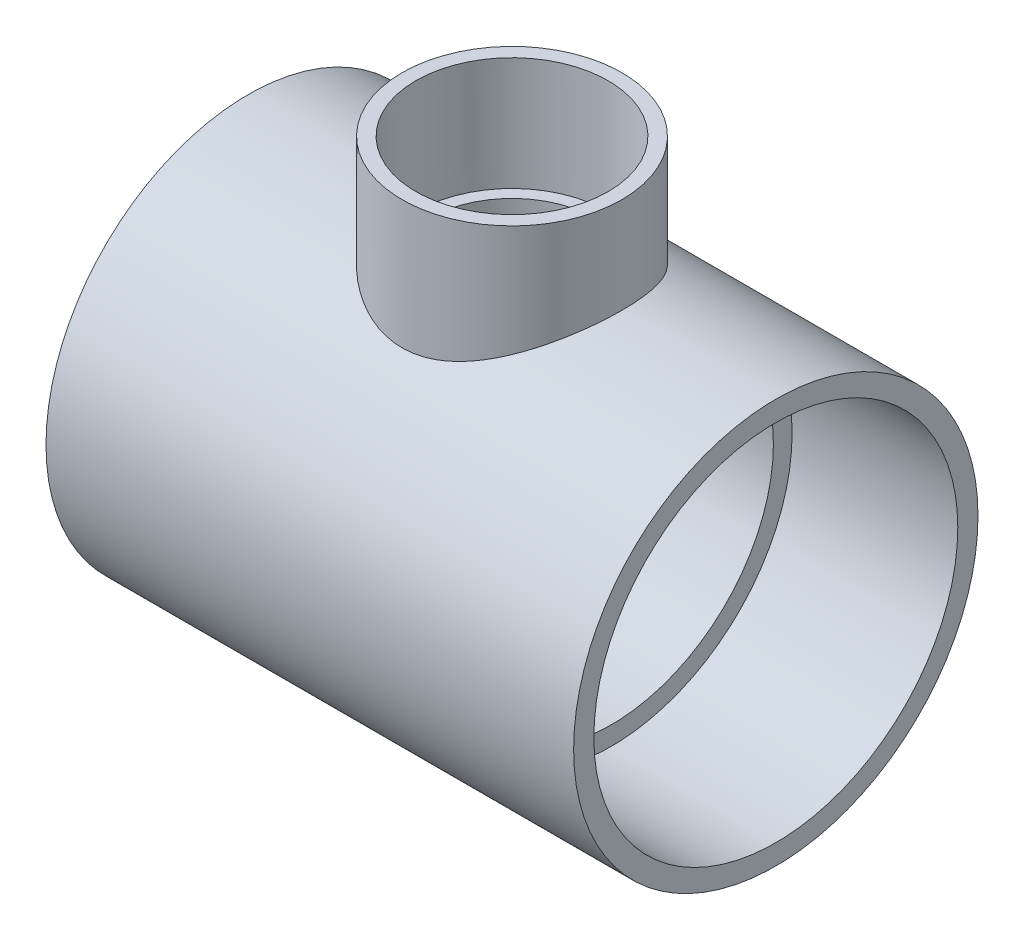
ISO-10303-21;
HEADER;
FILE_DESCRIPTION(('STEP AP214'),'2;1');
FILE_NAME('part.step','',(''),(''),'','','');
FILE_SCHEMA(('AUTOMOTIVE_DESIGN { 1 0 10303 214 1 1 1 1 }'));
ENDSEC;
DATA;
#1=APPLICATION_CONTEXT('core data for automotive mechanical design processes');
#2=APPLICATION_PROTOCOL_DEFINITION('international standard','automotive_design',2000,#1);
#3=PRODUCT_CONTEXT('',#1,'mechanical');
#4=PRODUCT('Part','Part','',(#3));
#5=PRODUCT_RELATED_PRODUCT_CATEGORY('part','',(#4));
#6=PRODUCT_DEFINITION_FORMATION('','',#4);
#7=PRODUCT_DEFINITION_CONTEXT('part definition',#1,'design');
#8=PRODUCT_DEFINITION('design','',#6,#7);
#9=PRODUCT_DEFINITION_SHAPE('','',#8);
#10=(LENGTH_UNIT() NAMED_UNIT(*) SI_UNIT(.MILLI.,.METRE.));
#11=(NAMED_UNIT(*) PLANE_ANGLE_UNIT() SI_UNIT($,.RADIAN.));
#12=(NAMED_UNIT(*) SI_UNIT($,.STERADIAN.) SOLID_ANGLE_UNIT());
#13=UNCERTAINTY_MEASURE_WITH_UNIT(LENGTH_MEASURE(1.E-05),#10,'distance_accuracy_value','');
#14=(GEOMETRIC_REPRESENTATION_CONTEXT(3) GLOBAL_UNCERTAINTY_ASSIGNED_CONTEXT((#13)) GLOBAL_UNIT_ASSIGNED_CONTEXT((#10,
#11,#12)) REPRESENTATION_CONTEXT('',''));
#15=CARTESIAN_POINT('',(0.,0.,0.));
#16=DIRECTION('',(0.,0.,1.));
#17=DIRECTION('',(1.,0.,0.));
#18=AXIS2_PLACEMENT_3D('',#15,#16,#17);
#19=CARTESIAN_POINT('',(-31.2928,0.,0.));
#20=DIRECTION('',(1.,0.,0.));
#21=DIRECTION('',(0.,0.,-1.));
#22=AXIS2_PLACEMENT_3D('',#19,#20,#21);
#23=PLANE('',#22);
#24=CARTESIAN_POINT('',(-31.2928,0.,0.));
#25=DIRECTION('',(-1.,0.,0.));
#26=DIRECTION('',(0.,0.,1.));
#27=AXIS2_PLACEMENT_3D('',#24,#25,#26);
#28=CIRCLE('',#27,57.0357);
#29=CARTESIAN_POINT('',(-31.2928,0.,57.0357));
#30=VERTEX_POINT('',#29);
#31=EDGE_CURVE('E97',#30,#30,#28,.T.);
#32=ORIENTED_EDGE('',*,*,#31,.T.);
#33=EDGE_LOOP('',(#32));
#34=FACE_BOUND('',#33,.T.);
#35=CARTESIAN_POINT('',(-31.2928,0.,0.));
#36=DIRECTION('',(1.,0.,0.));
#37=DIRECTION('',(0.,0.,-1.));
#38=AXIS2_PLACEMENT_3D('',#35,#36,#37);
#39=CIRCLE('',#38,51.1302);
#40=CARTESIAN_POINT('',(-31.2928,0.,-51.1302));
#41=VERTEX_POINT('',#40);
#42=EDGE_CURVE('E100',#41,#41,#39,.T.);
#43=ORIENTED_EDGE('',*,*,#42,.T.);
#44=EDGE_LOOP('',(#43));
#45=FACE_BOUND('',#44,.T.);
#46=ADVANCED_FACE('F30',(#34,#45),#23,.F.);
#47=CARTESIAN_POINT('',(31.2928,0.,0.));
#48=DIRECTION('',(1.,0.,0.));
#49=DIRECTION('',(0.,0.,-1.));
#50=AXIS2_PLACEMENT_3D('',#47,#48,#49);
#51=PLANE('',#50);
#52=CARTESIAN_POINT('',(31.2928,0.,0.));
#53=DIRECTION('',(1.,0.,0.));
#54=DIRECTION('',(0.,0.,-1.));
#55=AXIS2_PLACEMENT_3D('',#52,#53,#54);
#56=CIRCLE('',#55,51.1302);
#57=CARTESIAN_POINT('',(31.2928,0.,-51.1302));
#58=VERTEX_POINT('',#57);
#59=EDGE_CURVE('E103',#58,#58,#56,.T.);
#60=ORIENTED_EDGE('',*,*,#59,.F.);
#61=EDGE_LOOP('',(#60));
#62=FACE_BOUND('',#61,.T.);
#63=CARTESIAN_POINT('',(31.2928,0.,0.));
#64=DIRECTION('',(1.,0.,0.));
#65=DIRECTION('',(0.,0.,-1.));
#66=AXIS2_PLACEMENT_3D('',#63,#64,#65);
#67=CIRCLE('',#66,57.0357);
#68=CARTESIAN_POINT('',(31.2928,0.,-57.0357));
#69=VERTEX_POINT('',#68);
#70=EDGE_CURVE('E10',#69,#69,#67,.F.);
#71=ORIENTED_EDGE('',*,*,#70,.F.);
#72=EDGE_LOOP('',(#71));
#73=FACE_BOUND('',#72,.T.);
#74=ADVANCED_FACE('F72',(#62,#73),#51,.T.);
#75=CARTESIAN_POINT('',(31.2928,0.,0.));
#76=DIRECTION('',(-1.,0.,0.));
#77=DIRECTION('',(0.,0.,1.));
#78=AXIS2_PLACEMENT_3D('',#75,#76,#77);
#79=CYLINDRICAL_SURFACE('',#78,63.754);
#80=CARTESIAN_POINT('',(-83.185,0.,0.));
#81=DIRECTION('',(-1.,0.,0.));
#82=DIRECTION('',(0.,0.,1.));
#83=AXIS2_PLACEMENT_3D('',#80,#81,#82);
#84=CIRCLE('',#83,63.754);
#85=CARTESIAN_POINT('',(-83.185,0.,63.754));
#86=VERTEX_POINT('',#85);
#87=EDGE_CURVE('E114',#86,#86,#84,.T.);
#88=ORIENTED_EDGE('',*,*,#87,.F.);
#89=EDGE_LOOP('',(#88));
#90=FACE_BOUND('',#89,.T.);
#91=CARTESIAN_POINT('',(83.185,0.,0.));
#92=DIRECTION('',(-1.,0.,0.));
#93=DIRECTION('',(0.,0.,1.));
#94=AXIS2_PLACEMENT_3D('',#91,#92,#93);
#95=CIRCLE('',#94,63.754);
#96=CARTESIAN_POINT('',(83.185,0.,63.754));
#97=VERTEX_POINT('',#96);
#98=EDGE_CURVE('E102',#97,#97,#95,.T.);
#99=ORIENTED_EDGE('',*,*,#98,.T.);
#100=EDGE_LOOP('',(#99));
#101=FACE_BOUND('',#100,.T.);
#102=CARTESIAN_POINT('',(31.2928,61.9817199409632,-14.9277898283704));
#103=CARTESIAN_POINT('',(30.8590157260192,61.7627119969885,-15.8371083722885));
#104=CARTESIAN_POINT('',(30.3869858184902,61.5277706665448,-16.7245584747261));
#105=CARTESIAN_POINT('',(29.3712803613428,61.0325307236944,-18.450185129861));
#106=CARTESIAN_POINT('',(28.8275798090315,60.77222327048,-19.2883443389182));
#107=CARTESIAN_POINT('',(27.6722196390954,60.2327536392147,-20.9122231813222));
#108=CARTESIAN_POINT('',(27.0604465862179,59.9535603028201,-21.6978516831449));
#109=CARTESIAN_POINT('',(25.7740308973493,59.3840243508343,-23.2112894022233));
#110=CARTESIAN_POINT('',(25.0993932703106,59.0936826246117,-23.9391032175184));
#111=CARTESIAN_POINT('',(23.6928543122952,58.5101460612098,-25.331877550225));
#112=CARTESIAN_POINT('',(22.9610995248884,58.2169601124104,-25.9969898391331));
#113=CARTESIAN_POINT('',(21.442442915724,57.634892187325,-27.2631113880132));
#114=CARTESIAN_POINT('',(20.655539977556,57.3460102983133,-27.8641193496459));
#115=CARTESIAN_POINT('',(19.030197166982,56.7808263032757,-28.9984802330891));
#116=CARTESIAN_POINT('',(18.1917620458315,56.5045230415798,-29.531839378255));
#117=CARTESIAN_POINT('',(16.4670411902507,55.9730735799562,-30.5271343246348));
#118=CARTESIAN_POINT('',(15.5807556884279,55.7179272771967,-30.989070473004));
#119=CARTESIAN_POINT('',(13.7546630167047,55.2349627080885,-31.8420229499765));
#120=CARTESIAN_POINT('',(12.8143684209483,55.0074816964567,-32.232189060062));
#121=CARTESIAN_POINT('',(10.8949439156419,54.5922837755252,-32.9305416416512));
#122=CARTESIAN_POINT('',(9.91581349196638,54.4045673928557,-33.2387270274421));
#123=CARTESIAN_POINT('',(8.42492269087113,54.1593303687712,-33.6357448659006));
#124=CARTESIAN_POINT('',(7.9245748237696,54.0836763788385,-33.7571527206711));
#125=CARTESIAN_POINT('',(6.91728389396405,53.9452913573147,-33.9778618127677));
#126=CARTESIAN_POINT('',(6.41034177538884,53.8825584969344,-34.077166178667));
#127=CARTESIAN_POINT('',(5.39109966152885,53.7708256578644,-34.2532000139368));
#128=CARTESIAN_POINT('',(4.87880021618588,53.7218242836858,-34.3299317773315));
#129=CARTESIAN_POINT('',(3.85017817729677,53.6381876565941,-34.4604592681911));
#130=CARTESIAN_POINT('',(3.33385576397771,53.6035517638416,-34.5142560171861));
#131=CARTESIAN_POINT('',(1.930240308997,53.5297940522695,-34.6286259688408));
#132=CARTESIAN_POINT('',(1.04021689631093,53.5049941199507,-34.6668184035609));
#133=CARTESIAN_POINT('',(-0.740049868829083,53.4999926819212,-34.6745319127994));
#134=CARTESIAN_POINT('',(-1.63029318871182,53.5197865304321,-34.6440601407522));
#135=CARTESIAN_POINT('',(-3.40382496706583,53.6031309317315,-34.5149639876215));
#136=CARTESIAN_POINT('',(-4.28711286346325,53.6666849848518,-34.4163341546454));
#137=CARTESIAN_POINT('',(-6.03963643704365,53.835030589259,-34.1523993387477));
#138=CARTESIAN_POINT('',(-6.90887200378728,53.9398224644761,-33.9870938320768));
#139=CARTESIAN_POINT('',(-8.56677185903075,54.178026010521,-33.6059620665459));
#140=CARTESIAN_POINT('',(-9.35681045647687,54.3089140699209,-33.3944937352499));
#141=CARTESIAN_POINT('',(-10.9151688799396,54.5989839275586,-32.918097963334));
#142=CARTESIAN_POINT('',(-11.683490122599,54.7581638753311,-32.6531740188901));
#143=CARTESIAN_POINT('',(-13.1950748388329,55.1004729926893,-32.0721685408978));
#144=CARTESIAN_POINT('',(-13.9383356877965,55.2836046610337,-31.756081668968));
#145=CARTESIAN_POINT('',(-15.3971995681991,55.6693165648451,-31.0749563253676));
#146=CARTESIAN_POINT('',(-16.1127901868438,55.8719053899754,-30.709896205218));
#147=CARTESIAN_POINT('',(-17.6003281307498,56.3178650873149,-29.8850576231795));
#148=CARTESIAN_POINT('',(-18.3682969272791,56.5631807390275,-29.419148535285));
#149=CARTESIAN_POINT('',(-19.8628047059328,57.066015474453,-28.4314852721516));
#150=CARTESIAN_POINT('',(-20.5893554947366,57.3235310417242,-27.9097471348749));
#151=CARTESIAN_POINT('',(-21.9990157673711,57.8448086469135,-26.8126760334663));
#152=CARTESIAN_POINT('',(-22.6821039352303,58.1085736641231,-26.2373171071353));
#153=CARTESIAN_POINT('',(-24.0018281648006,58.6363046660367,-25.0357113550186));
#154=CARTESIAN_POINT('',(-24.6384655101702,58.9002706449832,-24.4094659364819));
#155=CARTESIAN_POINT('',(-25.8595321598407,59.421430074098,-23.1117421225272));
#156=CARTESIAN_POINT('',(-26.4442057364654,59.6786507108816,-22.4405045915711));
#157=CARTESIAN_POINT('',(-27.5619883191471,60.1822941225901,-21.0525289612542));
#158=CARTESIAN_POINT('',(-28.0950969751883,60.4287168242138,-20.3357905530939));
#159=CARTESIAN_POINT('',(-29.1064385894238,60.9055024669891,-18.8598379433071));
#160=CARTESIAN_POINT('',(-29.5846889308458,61.1358704863371,-18.1006373109655));
#161=CARTESIAN_POINT('',(-30.4831436195164,61.5756677132134,-16.5428102182876));
#162=CARTESIAN_POINT('',(-30.9033503130987,61.7850977670352,-15.7441853533935));
#163=CARTESIAN_POINT('',(-31.6658044163128,62.1700393611269,-14.1458681924474));
#164=CARTESIAN_POINT('',(-32.0105945315392,62.3466097387602,-13.3476450106495));
#165=CARTESIAN_POINT('',(-32.6407306497871,62.6724725955139,-11.7226385199715));
#166=CARTESIAN_POINT('',(-32.9260785488638,62.8217659446833,-10.8958561230386));
#167=CARTESIAN_POINT('',(-33.4344352890527,63.0896906315885,-9.21869501277959));
#168=CARTESIAN_POINT('',(-33.6574607584534,63.2083301474558,-8.36832266019623));
#169=CARTESIAN_POINT('',(-34.0388191461918,63.4122187888412,-6.64922211492018));
#170=CARTESIAN_POINT('',(-34.1971521502629,63.4974679586099,-5.78049394655507));
#171=CARTESIAN_POINT('',(-34.447578241495,63.6326862548744,-4.02837749354464));
#172=CARTESIAN_POINT('',(-34.5394905111318,63.6825590693826,-3.14495583857812));
#173=CARTESIAN_POINT('',(-34.6552130047454,63.7453974183923,-1.37234084747499));
#174=CARTESIAN_POINT('',(-34.6790230846354,63.7583628748072,-0.48314749913094));
#175=CARTESIAN_POINT('',(-34.6582337989739,63.747057763481,1.29417885321972));
#176=CARTESIAN_POINT('',(-34.6136358626651,63.7227879736926,2.18231187899158));
#177=CARTESIAN_POINT('',(-34.4566062592964,63.6376275673482,3.9507637942681));
#178=CARTESIAN_POINT('',(-34.3441756737503,63.57673753466,4.83108280813116));
#179=CARTESIAN_POINT('',(-34.0576904204966,63.4224450007617,6.54865891398556));
#180=CARTESIAN_POINT('',(-33.8857877053165,63.3301795620299,7.38637926750427));
#181=CARTESIAN_POINT('',(-33.4817551741187,63.1149189337697,9.04307995630684));
#182=CARTESIAN_POINT('',(-33.2496269463314,62.9919245546092,9.86206078515834));
#183=CARTESIAN_POINT('',(-32.7274503371776,62.7178675339297,11.4765951530468));
#184=CARTESIAN_POINT('',(-32.4373943875603,62.5668012249955,12.2721456153083));
#185=CARTESIAN_POINT('',(-31.8020101791536,62.2397619000605,13.8355518113807));
#186=CARTESIAN_POINT('',(-31.4566794043849,62.063787750356,14.6034062825851));
#187=CARTESIAN_POINT('',(-30.6924421299424,61.6798588457154,16.1504864498908));
#188=CARTESIAN_POINT('',(-30.270474817673,61.4706567832863,16.927889933097));
#189=CARTESIAN_POINT('',(-29.3711842018429,61.0328312919572,18.44421027889));
#190=CARTESIAN_POINT('',(-28.8938593456369,60.8042073183677,19.1831260611472));
#191=CARTESIAN_POINT('',(-27.8867704846506,60.3321498334306,20.6198014726789));
#192=CARTESIAN_POINT('',(-27.3569831276333,60.0887097458477,21.3175425516329));
#193=CARTESIAN_POINT('',(-26.2480690740639,59.5920268893773,22.6689479023861));
#194=CARTESIAN_POINT('',(-25.6689395112762,59.3387835514964,23.3226096097056));
#195=CARTESIAN_POINT('',(-24.3943292575001,58.7980183657223,24.6564721411008));
#196=CARTESIAN_POINT('',(-23.6931396560497,58.5099210883499,25.3309904609271));
#197=CARTESIAN_POINT('',(-22.2360955457662,57.9352237062824,26.6191617790265));
#198=CARTESIAN_POINT('',(-21.4802368485735,57.6486237181066,27.232810105312));
#199=CARTESIAN_POINT('',(-20.3079598339419,57.2256462016266,28.1052066017641));
#200=CARTESIAN_POINT('',(-19.910580212244,57.0857400539315,28.3881206032739));
#201=CARTESIAN_POINT('',(-19.1034526091876,56.8092635985235,28.937425246869));
#202=CARTESIAN_POINT('',(-18.6937057818872,56.6726929816909,29.2038174236611));
#203=CARTESIAN_POINT('',(-17.8623207372737,56.4039189894311,29.7196065190802));
#204=CARTESIAN_POINT('',(-17.4406839157479,56.2717151053091,29.9690054209319));
#205=CARTESIAN_POINT('',(-16.5858296887173,56.0126592663368,30.4504395946741));
#206=CARTESIAN_POINT('',(-16.1526081659364,55.8858092567201,30.6824685788087));
#207=CARTESIAN_POINT('',(-14.8071214493913,55.5066528972256,31.3665723160076));
#208=CARTESIAN_POINT('',(-13.8767390249412,55.2648382028659,31.7893942476696));
#209=CARTESIAN_POINT('',(-11.9745614247553,54.818161551834,32.5536180322939));
#210=CARTESIAN_POINT('',(-11.0027732967994,54.6132933372169,32.8950336769053));
#211=CARTESIAN_POINT('',(-9.52024599770114,54.3405306656693,33.3423073707075));
#212=CARTESIAN_POINT('',(-9.02222051620707,54.2554051098887,33.4805299189212));
#213=CARTESIAN_POINT('',(-8.01872217418492,54.0975866701437,33.7349388088565));
#214=CARTESIAN_POINT('',(-7.51325130023228,54.0248905327733,33.8511309179259));
#215=CARTESIAN_POINT('',(-6.4959617836311,53.8928334574071,34.0609807616227));
#216=CARTESIAN_POINT('',(-5.984143640097,53.8334714778148,34.1546402564237));
#217=CARTESIAN_POINT('',(-4.95542399030367,53.728841810527,34.3189957217159));
#218=CARTESIAN_POINT('',(-4.43852235182022,53.6835744904461,34.3896910932626));
#219=CARTESIAN_POINT('',(-3.023001970109,53.5801689106746,34.5507370130441));
#220=CARTESIAN_POINT('',(-2.12050998660511,53.5366611731156,34.6179140238652));
#221=CARTESIAN_POINT('',(-0.312180674103934,53.4955539964042,34.6814004034605));
#222=CARTESIAN_POINT('',(0.593656321705804,53.4979501019812,34.6777166497389));
#223=CARTESIAN_POINT('',(2.40095664431662,53.5485108708599,34.5995902926598));
#224=CARTESIAN_POINT('',(3.30242014876652,53.5966736592317,34.5251505879708));
#225=CARTESIAN_POINT('',(5.09338427765766,53.7367630337967,34.3066983777072));
#226=CARTESIAN_POINT('',(5.98288501545281,53.8286892050065,34.1626865318458));
#227=CARTESIAN_POINT('',(7.66554480441538,54.0427663920452,33.8228966861659));
#228=CARTESIAN_POINT('',(8.46029249473335,54.1615448703197,33.6327907896006));
#229=CARTESIAN_POINT('',(10.0296854897123,54.4287695498728,33.1985916451331));
#230=CARTESIAN_POINT('',(10.8043323884655,54.5772133903669,32.954502693065));
#231=CARTESIAN_POINT('',(12.3298927033022,54.8995853872136,32.4146076986792));
#232=CARTESIAN_POINT('',(13.0808055225499,55.073514183812,32.1188003570302));
#233=CARTESIAN_POINT('',(14.5561708679692,55.4424555391385,31.4776657412687));
#234=CARTESIAN_POINT('',(15.2806115209787,55.6374774068384,31.1323165808207));
#235=CARTESIAN_POINT('',(16.7790152604586,56.0665559202165,30.3534636635644));
#236=CARTESIAN_POINT('',(17.5495534580945,56.3025427129571,29.9144302022044));
#237=CARTESIAN_POINT('',(19.0513452523632,56.7885837579292,28.9811314097596));
#238=CARTESIAN_POINT('',(19.7826099385979,57.0386339978242,28.4868817926866));
#239=CARTESIAN_POINT('',(21.2041294232385,57.5470976758175,27.4452213408323));
#240=CARTESIAN_POINT('',(21.8943506366456,57.8055177027721,26.8977679097205));
#241=CARTESIAN_POINT('',(23.230672729586,58.32477478719,25.7524479512599));
#242=CARTESIAN_POINT('',(23.8767709547787,58.585611988995,25.154578395816));
#243=CARTESIAN_POINT('',(25.2065373432324,59.1392467596604,23.8266011172745));
#244=CARTESIAN_POINT('',(25.8834741637554,59.4315973075085,23.0895434348852));
#245=CARTESIAN_POINT('',(27.1731877125408,60.0045214734233,21.5568852526774));
#246=CARTESIAN_POINT('',(27.7859585469953,60.2850940082341,20.761279386469));
#247=CARTESIAN_POINT('',(28.94290677774,60.8270080337658,19.115390521678));
#248=CARTESIAN_POINT('',(29.4870827497773,61.0883491251323,18.2651063883496));
#249=CARTESIAN_POINT('',(30.5020328127949,61.584675969964,16.5144706367309));
#250=CARTESIAN_POINT('',(30.9728114350892,61.8196633501703,15.6141221139129));
#251=CARTESIAN_POINT('',(31.8276462943572,62.2523904690329,13.7868280288271));
#252=CARTESIAN_POINT('',(32.2132113260632,62.450765835963,12.8607405101482));
#253=CARTESIAN_POINT('',(32.9044465417655,62.81010780857,10.9720855456869));
#254=CARTESIAN_POINT('',(33.2101163052584,62.9710742173561,10.0095179079334));
#255=CARTESIAN_POINT('',(33.7371626032025,63.2506166811276,8.05632863902142));
#256=CARTESIAN_POINT('',(33.9586048747134,63.3692257902926,7.06572953707439));
#257=CARTESIAN_POINT('',(34.3141339942874,63.5604554222354,5.06464932910696));
#258=CARTESIAN_POINT('',(34.4482333366299,63.6330825226312,4.05417108808283));
#259=CARTESIAN_POINT('',(34.6165089651071,63.7243499229653,2.14166585746811));
#260=CARTESIAN_POINT('',(34.6605188318735,63.7483007582361,1.24074205350694));
#261=CARTESIAN_POINT('',(34.6781591659134,63.7578926854044,-0.561995017245191));
#262=CARTESIAN_POINT('',(34.6517931123217,63.7435356711056,-1.46380823786335));
#263=CARTESIAN_POINT('',(34.5290792272637,63.6769108739921,-3.26058236225636));
#264=CARTESIAN_POINT('',(34.4327795760145,63.6246691915647,-4.15554755518202));
#265=CARTESIAN_POINT('',(34.1714969872717,63.4836462830197,-5.93237598240269));
#266=CARTESIAN_POINT('',(34.0065244288954,63.3948705786208,-6.81424117576024));
#267=CARTESIAN_POINT('',(33.6652548506906,63.212571847357,-8.31536887038683));
#268=CARTESIAN_POINT('',(33.5049222314398,63.1272644143739,-8.93933377242985));
#269=CARTESIAN_POINT('',(33.15052555494,62.9398836440735,-10.17516973609));
#270=CARTESIAN_POINT('',(32.9564566010695,62.8378078730536,-10.7870390277258));
#271=CARTESIAN_POINT('',(32.5357233521242,62.6181713999637,-11.9964490509977));
#272=CARTESIAN_POINT('',(32.309066614647,62.5006142887794,-12.5939930674952));
#273=CARTESIAN_POINT('',(31.824270777442,62.2513879599248,-13.773183478172));
#274=CARTESIAN_POINT('',(31.5661276545604,62.1197169391194,-14.3548278291339));
#275=CARTESIAN_POINT('',(31.2928,61.9817199409632,-14.9277898283704));
#276=B_SPLINE_CURVE_WITH_KNOTS('',3,(#102,#103,#104,#105,#106,#107,#108,#109,#110,#111,#112,
#113,#114,#115,#116,#117,#118,#119,#120,#121,#122,#123,#124,#125,#126,#127,#128,#129,#130,#131,
#132,#133,#134,#135,#136,#137,#138,#139,#140,#141,#142,#143,#144,#145,#146,#147,#148,#149,#150,
#151,#152,#153,#154,#155,#156,#157,#158,#159,#160,#161,#162,#163,#164,#165,#166,#167,#168,#169,
#170,#171,#172,#173,#174,#175,#176,#177,#178,#179,#180,#181,#182,#183,#184,#185,#186,#187,#188,
#189,#190,#191,#192,#193,#194,#195,#196,#197,#198,#199,#200,#201,#202,#203,#204,#205,#206,#207,
#208,#209,#210,#211,#212,#213,#214,#215,#216,#217,#218,#219,#220,#221,#222,#223,#224,#225,#226,
#227,#228,#229,#230,#231,#232,#233,#234,#235,#236,#237,#238,#239,#240,#241,#242,#243,#244,#245,
#246,#247,#248,#249,#250,#251,#252,#253,#254,#255,#256,#257,#258,#259,#260,#261,#262,#263,#264,
#265,#266,#267,#268,#269,#270,#271,#272,#273,#274,#275),.UNSPECIFIED.,.T.,.F.,(4,2,2,2,2,2,2,2,
2,2,2,2,2,2,2,2,2,2,2,2,2,2,2,2,2,2,2,2,2,2,2,2,2,2,2,2,2,2,2,2,2,2,2,2,2,2,2,2,2,2,2,2,2,2,2,2,
2,2,2,2,2,2,2,2,2,2,2,2,2,2,2,2,2,2,2,2,2,2,2,2,2,2,2,2,2,2,4),(0.,3.09239640093276,
6.18587447030999,9.28458694108796,12.3830527220089,15.4738148680344,18.5646396010415,
21.6551797869596,24.7457049506696,27.8707668341538,30.9958701023796,32.5565008667842,
34.1169105956358,35.6771616872528,37.2373432777143,39.9068909562617,42.5761605343,
45.2456436491576,47.91514773369,50.3973707271953,52.8794314276021,55.3617512753727,
57.845172063434,60.6357942157101,63.4256168496818,66.2167973525847,69.0079006925725,
71.7851003739573,74.5623189052898,77.3386549601541,80.1148787526322,82.7738710951512,
85.4327786095991,88.0909760203406,90.7491699083038,93.414573227688,96.0799821863819,
98.7453354576761,101.410646234089,103.988159234363,106.565604268947,109.143386267002,
111.72128563298,114.445297182074,117.169385151591,119.894691171355,122.620155609286,
125.661018428407,128.702114464212,130.22416670395,131.746077348357,133.267810070689,
134.790091009476,137.935977078128,141.081329799348,142.652215158557,144.222688706217,
145.793039533782,147.36343131555,150.077352833309,152.791010948431,155.504557897549,
158.218079116149,160.692759305192,163.167242636303,165.641788143285,168.11743022847,
170.867780611264,173.617350253948,176.369139697636,179.121094537285,182.245128582271,
185.369449326434,188.493834931002,191.618027569701,194.681448219034,197.744884991388,
200.805925912073,203.86652885907,206.57001099005,209.273359472986,211.974847269415,
214.675926915309,216.624366166174,218.573088457506,220.521359537613,222.46987981817),.UNSPECIFIED.);
#277=CARTESIAN_POINT('',(31.2928,61.9817199409632,-14.9277898283704));
#278=VERTEX_POINT('',#277);
#279=EDGE_CURVE('E55',#278,#278,#276,.T.);
#280=ORIENTED_EDGE('',*,*,#279,.F.);
#281=EDGE_LOOP('',(#280));
#282=FACE_BOUND('',#281,.T.);
#283=ADVANCED_FACE('F67',(#90,#101,#282),#79,.T.);
#284=CARTESIAN_POINT('',(-31.2928,0.,0.));
#285=DIRECTION('',(-1.,0.,0.));
#286=DIRECTION('',(0.,0.,1.));
#287=AXIS2_PLACEMENT_3D('',#284,#285,#286);
#288=CONICAL_SURFACE('',#287,57.0357,0.00660783334011333);
#289=CARTESIAN_POINT('',(-83.185,0.,0.));
#290=DIRECTION('',(-1.,0.,0.));
#291=DIRECTION('',(0.,0.,1.));
#292=AXIS2_PLACEMENT_3D('',#289,#290,#291);
#293=CIRCLE('',#292,57.3786);
#294=CARTESIAN_POINT('',(-83.185,0.,57.3786));
#295=VERTEX_POINT('',#294);
#296=EDGE_CURVE('E62',#295,#295,#293,.T.);
#297=ORIENTED_EDGE('',*,*,#296,.T.);
#298=EDGE_LOOP('',(#297));
#299=FACE_BOUND('',#298,.T.);
#300=ORIENTED_EDGE('',*,*,#31,.F.);
#301=EDGE_LOOP('',(#300));
#302=FACE_BOUND('',#301,.T.);
#303=ADVANCED_FACE('F71',(#299,#302),#288,.F.);
#304=CARTESIAN_POINT('',(83.185,0.,0.));
#305=DIRECTION('',(1.,0.,0.));
#306=DIRECTION('',(0.,0.,-1.));
#307=AXIS2_PLACEMENT_3D('',#304,#305,#306);
#308=CONICAL_SURFACE('',#307,57.3786,0.00660783334011306);
#309=CARTESIAN_POINT('',(83.185,0.,0.));
#310=DIRECTION('',(-1.,0.,0.));
#311=DIRECTION('',(0.,0.,1.));
#312=AXIS2_PLACEMENT_3D('',#309,#310,#311);
#313=CIRCLE('',#312,57.3786);
#314=CARTESIAN_POINT('',(83.185,0.,57.3786));
#315=VERTEX_POINT('',#314);
#316=EDGE_CURVE('E106',#315,#315,#313,.T.);
#317=ORIENTED_EDGE('',*,*,#316,.F.);
#318=EDGE_LOOP('',(#317));
#319=FACE_BOUND('',#318,.T.);
#320=ORIENTED_EDGE('',*,*,#70,.T.);
#321=EDGE_LOOP('',(#320));
#322=FACE_BOUND('',#321,.T.);
#323=ADVANCED_FACE('F84',(#319,#322),#308,.F.);
#324=CARTESIAN_POINT('',(0.,0.,0.));
#325=DIRECTION('',(0.,-1.,0.));
#326=DIRECTION('',(1.,0.,0.));
#327=AXIS2_PLACEMENT_3D('',#324,#325,#326);
#328=CYLINDRICAL_SURFACE('',#327,34.671);
#329=ORIENTED_EDGE('',*,*,#279,.T.);
#330=EDGE_LOOP('',(#329));
#331=FACE_BOUND('',#330,.T.);
#332=CARTESIAN_POINT('',(0.,93.98,0.));
#333=DIRECTION('',(0.,-1.,0.));
#334=DIRECTION('',(1.,0.,0.));
#335=AXIS2_PLACEMENT_3D('',#332,#333,#334);
#336=CIRCLE('',#335,34.671);
#337=CARTESIAN_POINT('',(34.671,93.98,0.));
#338=VERTEX_POINT('',#337);
#339=EDGE_CURVE('E43',#338,#338,#336,.T.);
#340=ORIENTED_EDGE('',*,*,#339,.T.);
#341=EDGE_LOOP('',(#340));
#342=FACE_BOUND('',#341,.T.);
#343=ADVANCED_FACE('F64',(#331,#342),#328,.T.);
#344=CARTESIAN_POINT('',(0.,93.98,0.));
#345=DIRECTION('',(0.,1.,0.));
#346=DIRECTION('',(-1.,0.,0.));
#347=AXIS2_PLACEMENT_3D('',#344,#345,#346);
#348=CONICAL_SURFACE('',#347,30.3149,0.00642848287391577);
#349=CARTESIAN_POINT('',(0.,93.98,0.));
#350=DIRECTION('',(0.,-1.,0.));
#351=DIRECTION('',(1.,0.,0.));
#352=AXIS2_PLACEMENT_3D('',#349,#350,#351);
#353=CIRCLE('',#352,30.3149);
#354=CARTESIAN_POINT('',(30.3149,93.98,0.));
#355=VERTEX_POINT('',#354);
#356=EDGE_CURVE('E52',#355,#355,#353,.T.);
#357=ORIENTED_EDGE('',*,*,#356,.F.);
#358=EDGE_LOOP('',(#357));
#359=FACE_BOUND('',#358,.T.);
#360=CARTESIAN_POINT('',(0.,58.42,0.));
#361=DIRECTION('',(0.,-1.,0.));
#362=DIRECTION('',(1.,0.,0.));
#363=AXIS2_PLACEMENT_3D('',#360,#361,#362);
#364=CIRCLE('',#363,30.0863);
#365=CARTESIAN_POINT('',(30.0863,58.42,0.));
#366=VERTEX_POINT('',#365);
#367=EDGE_CURVE('E47',#366,#366,#364,.T.);
#368=ORIENTED_EDGE('',*,*,#367,.T.);
#369=EDGE_LOOP('',(#368));
#370=FACE_BOUND('',#369,.T.);
#371=ADVANCED_FACE('F75',(#359,#370),#348,.F.);
#372=CARTESIAN_POINT('',(34.671,93.98,0.));
#373=DIRECTION('',(0.,1.,0.));
#374=DIRECTION('',(-1.,0.,0.));
#375=AXIS2_PLACEMENT_3D('',#372,#373,#374);
#376=PLANE('',#375);
#377=ORIENTED_EDGE('',*,*,#356,.T.);
#378=EDGE_LOOP('',(#377));
#379=FACE_BOUND('',#378,.T.);
#380=ORIENTED_EDGE('',*,*,#339,.F.);
#381=EDGE_LOOP('',(#380));
#382=FACE_BOUND('',#381,.T.);
#383=ADVANCED_FACE('F32',(#379,#382),#376,.T.);
#384=CARTESIAN_POINT('',(-83.185,-63.754,0.));
#385=DIRECTION('',(-1.,0.,0.));
#386=DIRECTION('',(0.,0.,1.));
#387=AXIS2_PLACEMENT_3D('',#384,#385,#386);
#388=PLANE('',#387);
#389=ORIENTED_EDGE('',*,*,#87,.T.);
#390=EDGE_LOOP('',(#389));
#391=FACE_BOUND('',#390,.T.);
#392=ORIENTED_EDGE('',*,*,#296,.F.);
#393=EDGE_LOOP('',(#392));
#394=FACE_BOUND('',#393,.T.);
#395=ADVANCED_FACE('F82',(#391,#394),#388,.T.);
#396=CARTESIAN_POINT('',(83.185,-63.754,0.));
#397=DIRECTION('',(1.,0.,0.));
#398=DIRECTION('',(0.,0.,-1.));
#399=AXIS2_PLACEMENT_3D('',#396,#397,#398);
#400=PLANE('',#399);
#401=ORIENTED_EDGE('',*,*,#316,.T.);
#402=EDGE_LOOP('',(#401));
#403=FACE_BOUND('',#402,.T.);
#404=ORIENTED_EDGE('',*,*,#98,.F.);
#405=EDGE_LOOP('',(#404));
#406=FACE_BOUND('',#405,.T.);
#407=ADVANCED_FACE('F122',(#403,#406),#400,.T.);
#408=CARTESIAN_POINT('',(0.,58.42,0.));
#409=DIRECTION('',(0.,-1.,0.));
#410=DIRECTION('',(1.,0.,0.));
#411=AXIS2_PLACEMENT_3D('',#408,#409,#410);
#412=PLANE('',#411);
#413=CARTESIAN_POINT('',(0.,58.42,0.));
#414=DIRECTION('',(0.,-1.,0.));
#415=DIRECTION('',(0.,0.,-1.));
#416=AXIS2_PLACEMENT_3D('',#413,#414,#415);
#417=CIRCLE('',#416,26.2509);
#418=CARTESIAN_POINT('',(0.,58.42,-26.2509));
#419=VERTEX_POINT('',#418);
#420=EDGE_CURVE('E154',#419,#419,#417,.T.);
#421=ORIENTED_EDGE('',*,*,#420,.T.);
#422=EDGE_LOOP('',(#421));
#423=FACE_BOUND('',#422,.T.);
#424=ORIENTED_EDGE('',*,*,#367,.F.);
#425=EDGE_LOOP('',(#424));
#426=FACE_BOUND('',#425,.T.);
#427=ADVANCED_FACE('F128',(#423,#426),#412,.F.);
#428=CARTESIAN_POINT('',(83.185,0.,0.));
#429=DIRECTION('',(1.,0.,0.));
#430=DIRECTION('',(0.,0.,-1.));
#431=AXIS2_PLACEMENT_3D('',#428,#429,#430);
#432=CYLINDRICAL_SURFACE('',#431,51.1302);
#433=CARTESIAN_POINT('',(0.,43.876959799307,-26.2509));
#434=CARTESIAN_POINT('',(0.681360378573567,43.8769615282513,-26.2508989027059));
#435=CARTESIAN_POINT('',(1.36274515454134,43.8928845956468,-26.2243378398937));
#436=CARTESIAN_POINT('',(2.72020613639835,43.9559679654755,-26.1184602524268));
#437=CARTESIAN_POINT('',(3.39627992839956,44.003141724596,-26.0391210011872));
#438=CARTESIAN_POINT('',(4.73872979111499,44.1270391806309,-25.8286013471756));
#439=CARTESIAN_POINT('',(5.40508706198772,44.2038138561949,-25.6973314993971));
#440=CARTESIAN_POINT('',(6.72212141352884,44.3841062591454,-25.3846596307875));
#441=CARTESIAN_POINT('',(7.37279982078404,44.4876217152498,-25.2032618675808));
#442=CARTESIAN_POINT('',(8.65091715025692,44.7172542704607,-24.7935331414108));
#443=CARTESIAN_POINT('',(9.27846569583563,44.8432417216127,-24.5654703478461));
#444=CARTESIAN_POINT('',(10.5108445560754,45.1143438683234,-24.0639672696687));
#445=CARTESIAN_POINT('',(11.1156744629179,45.2594589070276,-23.7905261709543));
#446=CARTESIAN_POINT('',(12.2998449303287,45.5647501640274,-23.2004565255452));
#447=CARTESIAN_POINT('',(12.8791867505425,45.7249256367918,-22.8838301162877));
#448=CARTESIAN_POINT('',(14.0101398409067,46.0562613759152,-22.2094412078197));
#449=CARTESIAN_POINT('',(14.5617486806249,46.2274226020494,-21.8516751122551));
#450=CARTESIAN_POINT('',(15.6819993598854,46.5919327799858,-21.0640327469858));
#451=CARTESIAN_POINT('',(16.2479292897617,46.7859147436644,-20.6305885180239));
#452=CARTESIAN_POINT('',(17.3420812706282,47.1770525060047,-19.7197546502493));
#453=CARTESIAN_POINT('',(17.8703015599427,47.3742084524183,-19.2423629607318));
#454=CARTESIAN_POINT('',(18.8868195610455,47.7669306933848,-18.2456758013194));
#455=CARTESIAN_POINT('',(19.3750974446156,47.9624961555266,-17.726359770446));
#456=CARTESIAN_POINT('',(20.3088762155935,48.3472550142516,-16.6483582324288));
#457=CARTESIAN_POINT('',(20.7543757373299,48.5364482072792,-16.0896714693866));
#458=CARTESIAN_POINT('',(21.6304087000466,48.9172310175402,-14.8937387191846));
#459=CARTESIAN_POINT('',(22.0575397094158,49.1080075601519,-14.2537330891056));
#460=CARTESIAN_POINT('',(22.85592185196,49.4717542286781,-12.9348669817345));
#461=CARTESIAN_POINT('',(23.2271695617363,49.6447232635035,-12.2560041275706));
#462=CARTESIAN_POINT('',(23.909893486515,49.9677916015145,-10.8640367600959));
#463=CARTESIAN_POINT('',(24.2214001676232,50.1179025535373,-10.1509499331926));
#464=CARTESIAN_POINT('',(24.7812129036814,50.390835836477,-8.69534719560555));
#465=CARTESIAN_POINT('',(25.0295261010698,50.5136612511401,-7.95283462173806));
#466=CARTESIAN_POINT('',(25.4436709731542,50.7201958699173,-6.5004960996865));
#467=CARTESIAN_POINT('',(25.6142615375841,50.8061339576268,-5.79234282341545));
#468=CARTESIAN_POINT('',(25.8963144886665,50.9489143077083,-4.36145256031731));
#469=CARTESIAN_POINT('',(26.0077795609387,51.0057578916173,-3.6387162374349));
#470=CARTESIAN_POINT('',(26.1700142361566,51.0886717838103,-2.18510020270275));
#471=CARTESIAN_POINT('',(26.2208166777651,51.1147587415636,-1.4542251131205));
#472=CARTESIAN_POINT('',(26.261105680543,51.1354372452788,0.00963907222275532));
#473=CARTESIAN_POINT('',(26.2505962656021,51.130030858145,0.742628026095348));
#474=CARTESIAN_POINT('',(26.1722070371593,51.0898335571942,2.13715873417461));
#475=CARTESIAN_POINT('',(26.1096763908311,51.0577826298751,2.79908864839921));
#476=CARTESIAN_POINT('',(25.9349191851809,50.968637152418,4.11459883206475));
#477=CARTESIAN_POINT('',(25.8226963213238,50.9115444645655,4.76817971868058));
#478=CARTESIAN_POINT('',(25.5497997960736,50.7736745318275,6.06259338186231));
#479=CARTESIAN_POINT('',(25.3891245385686,50.6928965067054,6.70342573772656));
#480=CARTESIAN_POINT('',(25.0209881428698,50.5095237483319,7.96830022372332));
#481=CARTESIAN_POINT('',(24.8135252840604,50.4069282127487,8.5923417354271));
#482=CARTESIAN_POINT('',(24.3507618728345,50.1807327098973,9.82808025001975));
#483=CARTESIAN_POINT('',(24.0948698088195,50.056875000707,10.4395081498925));
#484=CARTESIAN_POINT('',(23.5393004950158,49.7918334809505,11.6381915198034));
#485=CARTESIAN_POINT('',(23.2396233350428,49.650649705925,12.2254470394228));
#486=CARTESIAN_POINT('',(22.5986760199465,49.3538961127088,13.3731723675957));
#487=CARTESIAN_POINT('',(22.2573955377453,49.1983227249457,13.9336354772823));
#488=CARTESIAN_POINT('',(21.5355372847616,48.8759928225878,15.0252670925907));
#489=CARTESIAN_POINT('',(21.1549572848071,48.7092356738088,15.5564339338265));
#490=CARTESIAN_POINT('',(20.3174027801926,48.3510847116604,16.638075706734));
#491=CARTESIAN_POINT('',(19.8565962605664,48.1588801512904,17.1853193498645));
#492=CARTESIAN_POINT('',(18.8928770693469,47.769593662605,18.2394928572556));
#493=CARTESIAN_POINT('',(18.3899619371045,47.5725114497348,18.7464203622318));
#494=CARTESIAN_POINT('',(17.344075233649,47.1780654213446,19.7180774355136));
#495=CARTESIAN_POINT('',(16.8010722268174,46.9807015064385,20.1827732361826));
#496=CARTESIAN_POINT('',(15.9588561788822,46.6883646498237,20.8459200920531));
#497=CARTESIAN_POINT('',(15.6734873901959,46.5915335448613,21.0613272078594));
#498=CARTESIAN_POINT('',(15.0936892572042,46.3997002557649,21.4806502308998));
#499=CARTESIAN_POINT('',(14.7992571288204,46.3046986484824,21.684562551586));
#500=CARTESIAN_POINT('',(13.8613382189341,46.0103907439171,22.306071499044));
#501=CARTESIAN_POINT('',(13.2022396662042,45.8155249751867,22.7025237858073));
#502=CARTESIAN_POINT('',(11.8478265380968,45.4437552201776,23.4378401749337));
#503=CARTESIAN_POINT('',(11.152515224188,45.2668496205511,23.7767094517793));
#504=CARTESIAN_POINT('',(10.0858590040724,45.0199121340155,24.2391284748048));
#505=CARTESIAN_POINT('',(9.72643265170195,44.9406837347674,24.3855960659428));
#506=CARTESIAN_POINT('',(9.00026893431168,44.7891315845955,24.6628458148573));
#507=CARTESIAN_POINT('',(8.63353345933584,44.716806075973,24.7936319678195));
#508=CARTESIAN_POINT('',(7.52319376449865,44.5113221876114,25.1618546745927));
#509=CARTESIAN_POINT('',(6.7692473975193,44.3896073447288,25.3752462304988));
#510=CARTESIAN_POINT('',(5.30208690667712,44.1906605841503,25.7200159903222));
#511=CARTESIAN_POINT('',(4.59046418786746,44.1106413016763,25.8566043084634));
#512=CARTESIAN_POINT('',(3.15535974657625,43.9844674921495,26.0706642009238));
#513=CARTESIAN_POINT('',(2.43187872021063,43.938310984484,26.1481392327532));
#514=CARTESIAN_POINT('',(0.980082173109456,43.8819138037296,26.2426760526892));
#515=CARTESIAN_POINT('',(0.25177030249298,43.8716485560134,26.2597791773183));
#516=CARTESIAN_POINT('',(-1.20332984236283,43.8874300104708,26.2333969287243));
#517=CARTESIAN_POINT('',(-1.93011822921976,43.9134739264895,26.1899162043549));
#518=CARTESIAN_POINT('',(-3.28966260097373,43.9955092408858,26.0518319625615));
#519=CARTESIAN_POINT('',(-3.92334955872038,44.0475833219577,25.9639018684747));
#520=CARTESIAN_POINT('',(-5.18002271063439,44.1772532695359,25.74265106804));
#521=CARTESIAN_POINT('',(-5.80300992619396,44.25484668557,25.609334719825));
#522=CARTESIAN_POINT('',(-7.03468497538835,44.43312778225,25.2987451194118));
#523=CARTESIAN_POINT('',(-7.64336894826439,44.5338216210307,25.1214601449881));
#524=CARTESIAN_POINT('',(-8.8430496018647,44.7553289042614,24.7246731718263));
#525=CARTESIAN_POINT('',(-9.43404516146571,44.8761436208361,24.5051685036492));
#526=CARTESIAN_POINT('',(-10.6221418062711,45.1405235347161,24.0148190637524));
#527=CARTESIAN_POINT('',(-11.2182874731625,45.2848761459306,23.7420863830459));
#528=CARTESIAN_POINT('',(-12.3856438858416,45.58809002403,23.1545385238045));
#529=CARTESIAN_POINT('',(-12.9568522848196,45.7469526520997,22.8397193958523));
#530=CARTESIAN_POINT('',(-14.0722779405103,46.0752902183202,22.1698920507006));
#531=CARTESIAN_POINT('',(-14.6164852118496,46.2447690308212,21.8148691225886));
#532=CARTESIAN_POINT('',(-15.6757310117933,46.5904008599845,21.0666028613327));
#533=CARTESIAN_POINT('',(-16.1907675921705,46.7665543211191,20.6733569801398));
#534=CARTESIAN_POINT('',(-17.2569952725086,47.145634956569,19.7950717300261));
#535=CARTESIAN_POINT('',(-17.8037388596077,47.3489779127077,19.3047991195491));
#536=CARTESIAN_POINT('',(-18.8545984838269,47.7540404500057,18.2798427766269));
#537=CARTESIAN_POINT('',(-19.3587110783661,47.9557598988739,17.7451554644587));
#538=CARTESIAN_POINT('',(-20.3216722114234,48.3525119312738,16.6337070132546));
#539=CARTESIAN_POINT('',(-20.7805022350924,48.5475417585058,16.0569288306531));
#540=CARTESIAN_POINT('',(-21.6496558973066,48.9258839741544,14.8642723766117));
#541=CARTESIAN_POINT('',(-22.0599798439204,49.1091964369861,14.2483943535383));
#542=CARTESIAN_POINT('',(-22.841348321813,49.4650372756735,12.9602494387316));
#543=CARTESIAN_POINT('',(-23.2107019474024,49.6370281084883,12.2868052223589));
#544=CARTESIAN_POINT('',(-23.890743053376,49.9586370887447,10.9057125813356));
#545=CARTESIAN_POINT('',(-24.2014282784159,50.1082543760513,10.1980628430613));
#546=CARTESIAN_POINT('',(-24.7603426623982,50.3805779317522,8.75408716680882));
#547=CARTESIAN_POINT('',(-25.008618662081,50.5033043739214,8.01778321724765));
#548=CARTESIAN_POINT('',(-25.4397295699071,50.7181668872582,6.52192668211223));
#549=CARTESIAN_POINT('',(-25.6225727551071,50.8103068274207,5.76237705025208));
#550=CARTESIAN_POINT('',(-25.9060620919049,50.9538835750954,4.29964400000871));
#551=CARTESIAN_POINT('',(-26.0128581211791,51.0083513740615,3.59794467604743));
#552=CARTESIAN_POINT('',(-26.1693070695559,51.0883124740719,2.18657252609183));
#553=CARTESIAN_POINT('',(-26.2189637153514,51.11380766474,1.47690022315272));
#554=CARTESIAN_POINT('',(-26.2604632725206,51.1351075466472,0.0556617823675358));
#555=CARTESIAN_POINT('',(-26.2523252988014,51.1309220544322,-0.65590365152119));
#556=CARTESIAN_POINT('',(-26.178390338112,51.0930005230145,-2.07522451178897));
#557=CARTESIAN_POINT('',(-26.1125952353454,51.0592654494761,-2.78298006191249));
#558=CARTESIAN_POINT('',(-25.9310200138226,50.9666540390621,-4.13826987344875));
#559=CARTESIAN_POINT('',(-25.8191770506152,50.9097613191627,-4.78647305808664));
#560=CARTESIAN_POINT('',(-25.5478378932301,50.7726886373646,-6.07026581701618));
#561=CARTESIAN_POINT('',(-25.3883446174005,50.6925101016165,-6.70585616124095));
#562=CARTESIAN_POINT('',(-25.0233178869404,50.5106821474671,-7.96054376672965));
#563=CARTESIAN_POINT('',(-24.8177811470624,50.409031197017,-8.57963984758263));
#564=CARTESIAN_POINT('',(-24.3625811269728,50.1864877803578,-9.79781835097567));
#565=CARTESIAN_POINT('',(-24.1129157656028,50.0655944066798,-10.3968998280181));
#566=CARTESIAN_POINT('',(-23.5604349547525,49.801811078178,-11.5960840103069));
#567=CARTESIAN_POINT('',(-23.2558603379901,49.6582225958009,-12.1952219698045));
#568=CARTESIAN_POINT('',(-22.6035560896286,49.3561020244399,-13.3655473488322));
#569=CARTESIAN_POINT('',(-22.2558257217834,49.1975696805217,-13.9367342912803));
#570=CARTESIAN_POINT('',(-21.51946187917,48.8688680535937,-15.0488345103177));
#571=CARTESIAN_POINT('',(-21.1308149060405,48.6986949368261,-15.5897377056047));
#572=CARTESIAN_POINT('',(-20.3149652297327,48.3502777315464,-16.6389189867037));
#573=CARTESIAN_POINT('',(-19.8877588643366,48.1720328772155,-17.1471939657557));
#574=CARTESIAN_POINT('',(-18.950553501273,47.7923517044952,-18.1802635888454));
#575=CARTESIAN_POINT('',(-18.4365654572452,47.5904330144798,-18.7012682201702));
#576=CARTESIAN_POINT('',(-17.3669375246571,47.1863638859237,-19.6985778403341));
#577=CARTESIAN_POINT('',(-16.8112945399378,46.9842134312581,-20.1748795005207));
#578=CARTESIAN_POINT('',(-15.6604774070024,46.5848326148288,-21.0807023097684));
#579=CARTESIAN_POINT('',(-15.0652641690826,46.387607391135,-21.5101760601444));
#580=CARTESIAN_POINT('',(-13.8384667084096,46.0038211265882,-22.3191901756352));
#581=CARTESIAN_POINT('',(-13.206885023351,45.8172593434741,-22.698734018672));
#582=CARTESIAN_POINT('',(-12.2215861700586,45.5461265236203,-23.2355352216478));
#583=CARTESIAN_POINT('',(-11.8799006687324,45.4555579943043,-23.4120906687127));
#584=CARTESIAN_POINT('',(-11.1880940482581,45.2796765356315,-23.750464637076));
#585=CARTESIAN_POINT('',(-10.8379748710242,45.1943624122015,-23.9122865106331));
#586=CARTESIAN_POINT('',(-9.77542164886926,44.947438759096,-24.3751430093098));
#587=CARTESIAN_POINT('',(-9.05081102656053,44.7948532820621,-24.6535580810494));
#588=CARTESIAN_POINT('',(-7.57675544680843,44.5204666098137,-25.1456692283848));
#589=CARTESIAN_POINT('',(-6.82738903598981,44.3985769776885,-25.3595515883628));
#590=CARTESIAN_POINT('',(-5.30823982609808,44.1904962288211,-25.720439760684));
#591=CARTESIAN_POINT('',(-4.53847140105748,44.1042806541773,-25.8674913985604));
#592=CARTESIAN_POINT('',(-3.14084603751579,43.9848712069589,-26.0698894460067));
#593=CARTESIAN_POINT('',(-2.51537081774283,43.9445246051471,-26.1376895343989));
#594=CARTESIAN_POINT('',(-1.25993754339345,43.8905672326978,-26.2281967849078));
#595=CARTESIAN_POINT('',(-0.629979199963141,43.8769582007418,-26.2509010145475));
#596=CARTESIAN_POINT('',(0.,43.876959799307,-26.2509));
#597=B_SPLINE_CURVE_WITH_KNOTS('',3,(#433,#434,#435,#436,#437,#438,#439,#440,#441,#442,#443,
#444,#445,#446,#447,#448,#449,#450,#451,#452,#453,#454,#455,#456,#457,#458,#459,#460,#461,#462,
#463,#464,#465,#466,#467,#468,#469,#470,#471,#472,#473,#474,#475,#476,#477,#478,#479,#480,#481,
#482,#483,#484,#485,#486,#487,#488,#489,#490,#491,#492,#493,#494,#495,#496,#497,#498,#499,#500,
#501,#502,#503,#504,#505,#506,#507,#508,#509,#510,#511,#512,#513,#514,#515,#516,#517,#518,#519,
#520,#521,#522,#523,#524,#525,#526,#527,#528,#529,#530,#531,#532,#533,#534,#535,#536,#537,#538,
#539,#540,#541,#542,#543,#544,#545,#546,#547,#548,#549,#550,#551,#552,#553,#554,#555,#556,#557,
#558,#559,#560,#561,#562,#563,#564,#565,#566,#567,#568,#569,#570,#571,#572,#573,#574,#575,#576,
#577,#578,#579,#580,#581,#582,#583,#584,#585,#586,#587,#588,#589,#590,#591,#592,#593,#594,#595,
#596),.UNSPECIFIED.,.T.,.F.,(4,2,2,2,2,2,2,2,2,2,2,2,2,2,2,2,2,2,2,2,2,2,2,2,2,2,2,2,2,2,2,2,2,
2,2,2,2,2,2,2,2,2,2,2,2,2,2,2,2,2,2,2,2,2,2,2,2,2,2,2,2,2,2,2,2,2,2,2,2,2,2,2,2,2,2,2,2,2,2,2,2,
4),(0.,2.04342774104976,4.08773596364352,6.13558073117849,8.1832516180446,10.2194699823807,
12.2557248810882,14.2918790328381,16.3282113168757,18.5421848563384,20.7562617580838,
22.971431185366,25.1866713069958,27.5618395527942,29.9371532417237,32.3112523529754,
34.6850830125688,36.8824691377079,39.0797554438225,41.2758517470927,43.471803922455,
45.4663899085205,47.4608275879562,49.455330975045,51.4499077220215,53.4706341469679,
55.4913564268872,57.5125813304287,59.5339209462041,61.7538790793859,63.9739670281883,
66.195814778371,67.3068241762524,68.418178328496,70.795325110155,73.1722581652887,
74.3602516573444,75.5479418363094,77.922626093579,80.1066028102764,82.2904517773441,
84.4728051770995,86.6549911249147,88.5784173467676,90.5016589271616,92.4254138042858,
94.3492903553257,96.361094188789,98.3730869438178,100.385818297546,102.398683917725,
104.682145359271,106.965791021469,109.250366571064,111.534927610234,113.893074748152,
116.251312520064,118.607775015081,120.963939319137,123.096698698898,125.229318969875,
127.361233934034,129.49307923097,131.471533762391,133.449867148,135.428341734672,
137.406909653473,139.466580762873,141.526287015523,143.586674905891,145.647258690045,
147.922386863543,150.197684312422,152.475263821189,154.752684598578,155.937705117397,
157.122455336902,159.492022781857,161.854683153122,164.215721005108,166.104931635746,
167.994265113258),.UNSPECIFIED.);
#598=CARTESIAN_POINT('',(0.,43.876959799307,-26.2509));
#599=VERTEX_POINT('',#598);
#600=EDGE_CURVE('E34',#599,#599,#597,.T.);
#601=ORIENTED_EDGE('',*,*,#600,.F.);
#602=EDGE_LOOP('',(#601));
#603=FACE_BOUND('',#602,.T.);
#604=ORIENTED_EDGE('',*,*,#59,.T.);
#605=EDGE_LOOP('',(#604));
#606=FACE_BOUND('',#605,.T.);
#607=ORIENTED_EDGE('',*,*,#42,.F.);
#608=EDGE_LOOP('',(#607));
#609=FACE_BOUND('',#608,.T.);
#610=ADVANCED_FACE('F138',(#603,#606,#609),#432,.F.);
#611=CARTESIAN_POINT('',(0.,0.,0.));
#612=DIRECTION('',(0.,-1.,0.));
#613=DIRECTION('',(0.,0.,-1.));
#614=AXIS2_PLACEMENT_3D('',#611,#612,#613);
#615=CYLINDRICAL_SURFACE('',#614,26.2509);
#616=ORIENTED_EDGE('',*,*,#600,.T.);
#617=EDGE_LOOP('',(#616));
#618=FACE_BOUND('',#617,.T.);
#619=ORIENTED_EDGE('',*,*,#420,.F.);
#620=EDGE_LOOP('',(#619));
#621=FACE_BOUND('',#620,.T.);
#622=ADVANCED_FACE('F142',(#618,#621),#615,.F.);
#623=CLOSED_SHELL('',(#46,#74,#283,#303,#323,#343,#371,#383,#395,#407,#427,#610,#622));
#624=MANIFOLD_SOLID_BREP('B2',#623);
#625=ADVANCED_BREP_SHAPE_REPRESENTATION('',(#18,#624),#14);
#626=SHAPE_DEFINITION_REPRESENTATION(#9,#625);
ENDSEC;
END-ISO-10303-21;
